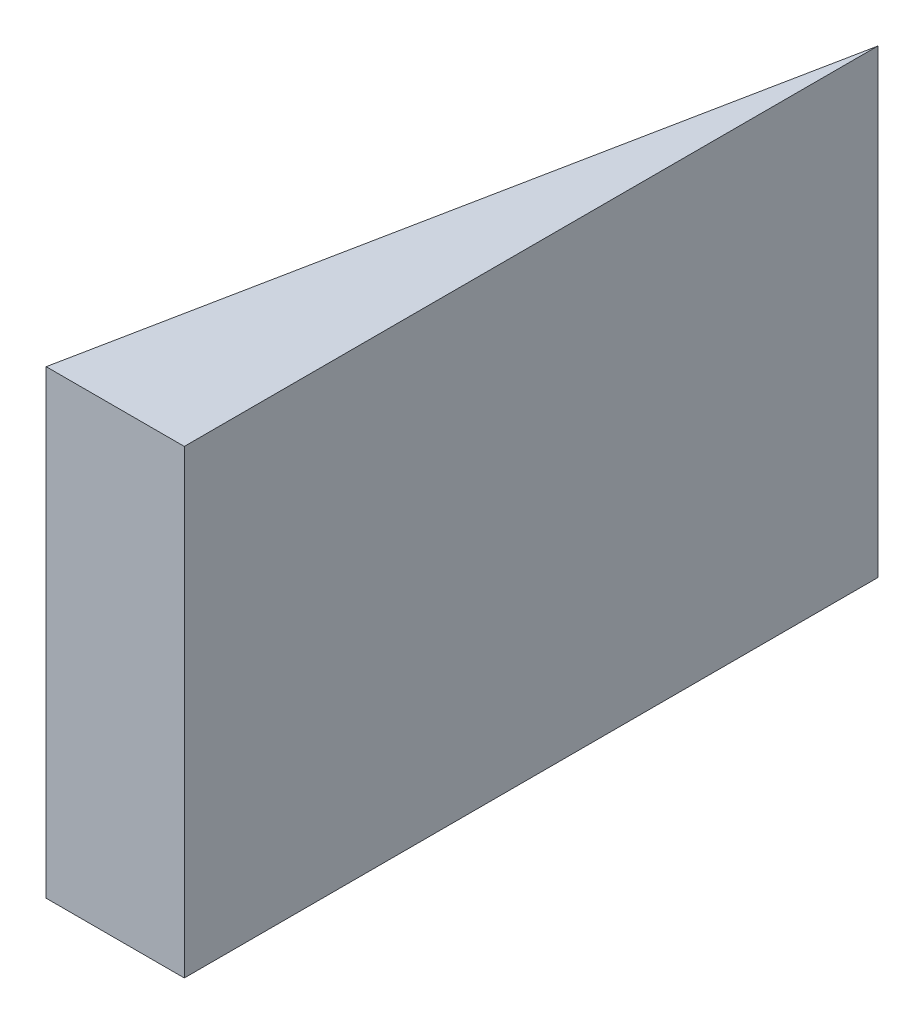
ISO-10303-21;
HEADER;
FILE_DESCRIPTION(('STEP AP214'),'2;1');
FILE_NAME('part.step','',(''),(''),'','','');
FILE_SCHEMA(('AUTOMOTIVE_DESIGN { 1 0 10303 214 1 1 1 1 }'));
ENDSEC;
DATA;
#1=APPLICATION_CONTEXT('core data for automotive mechanical design processes');
#2=APPLICATION_PROTOCOL_DEFINITION('international standard','automotive_design',2000,#1);
#3=PRODUCT_CONTEXT('',#1,'mechanical');
#4=PRODUCT('Part','Part','',(#3));
#5=PRODUCT_RELATED_PRODUCT_CATEGORY('part','',(#4));
#6=PRODUCT_DEFINITION_FORMATION('','',#4);
#7=PRODUCT_DEFINITION_CONTEXT('part definition',#1,'design');
#8=PRODUCT_DEFINITION('design','',#6,#7);
#9=PRODUCT_DEFINITION_SHAPE('','',#8);
#10=(LENGTH_UNIT() NAMED_UNIT(*) SI_UNIT(.MILLI.,.METRE.));
#11=(NAMED_UNIT(*) PLANE_ANGLE_UNIT() SI_UNIT($,.RADIAN.));
#12=(NAMED_UNIT(*) SI_UNIT($,.STERADIAN.) SOLID_ANGLE_UNIT());
#13=UNCERTAINTY_MEASURE_WITH_UNIT(LENGTH_MEASURE(1.E-05),#10,'distance_accuracy_value','');
#14=(GEOMETRIC_REPRESENTATION_CONTEXT(3) GLOBAL_UNCERTAINTY_ASSIGNED_CONTEXT((#13)) GLOBAL_UNIT_ASSIGNED_CONTEXT((#10,
#11,#12)) REPRESENTATION_CONTEXT('',''));
#15=CARTESIAN_POINT('',(0.,0.,0.));
#16=DIRECTION('',(0.,0.,1.));
#17=DIRECTION('',(1.,0.,0.));
#18=AXIS2_PLACEMENT_3D('',#15,#16,#17);
#19=CARTESIAN_POINT('',(-3.37532183744417,-0.749999455145353,-5.23287741907118));
#20=DIRECTION('',(-1.74845553146952E-07,-1.,-8.74227765734759E-08));
#21=DIRECTION('',(1.,-1.74845553146952E-07,0.));
#22=AXIS2_PLACEMENT_3D('',#19,#20,#21);
#23=PLANE('',#22);
#24=DIRECTION('',(-0.999999999999985,1.74845553220964E-07,0.));
#25=VECTOR('',#24,1.);
#26=CARTESIAN_POINT('',(-3.0000001311342,-0.749999659050171,-3.65112158656318));
#27=LINE('',#26,#25);
#28=CARTESIAN_POINT('',(-3.0000001311342,-0.749999659052171,-3.65112158656318));
#29=VERTEX_POINT('',#28);
#30=CARTESIAN_POINT('',(-3.3000001311342,-0.749999606598505,-3.65112158656418));
#31=VERTEX_POINT('',#30);
#32=EDGE_CURVE('E11',#29,#31,#27,.T.);
#33=ORIENTED_EDGE('',*,*,#32,.F.);
#34=DIRECTION('',(0.,-8.74227765663743E-08,0.999999999999996));
#35=VECTOR('',#34,1.);
#36=CARTESIAN_POINT('',(-3.00000013113417,-0.749999527353517,-5.15755571276118));
#37=LINE('',#36,#35);
#38=CARTESIAN_POINT('',(-3.00000013113417,-0.749999527355517,-5.15755571276018));
#39=VERTEX_POINT('',#38);
#40=EDGE_CURVE('E63',#39,#29,#37,.T.);
#41=ORIENTED_EDGE('',*,*,#40,.F.);
#42=DIRECTION('',(0.195310522456633,5.15899646635893E-08,-0.980741454114036));
#43=VECTOR('',#42,1.);
#44=CARTESIAN_POINT('',(-3.3000001311342,-0.749999606596505,-3.65112158656318));
#45=LINE('',#44,#43);
#46=EDGE_CURVE('E70',#31,#39,#45,.T.);
#47=ORIENTED_EDGE('',*,*,#46,.F.);
#48=EDGE_LOOP('',(#33,#41,#47));
#49=FACE_BOUND('',#48,.T.);
#50=ADVANCED_FACE('F17',(#49),#23,.F.);
#51=CARTESIAN_POINT('',(-3.37532201228973,-1.74999945514635,-5.23287750649395));
#52=DIRECTION('',(-1.74845553146952E-07,-1.,-8.74227765734759E-08));
#53=DIRECTION('',(1.,-1.74845553146952E-07,0.));
#54=AXIS2_PLACEMENT_3D('',#51,#52,#53);
#55=PLANE('',#54);
#56=DIRECTION('',(0.195310522456633,5.15899645913099E-08,-0.980741454114036));
#57=VECTOR('',#56,1.);
#58=CARTESIAN_POINT('',(-3.30000030597975,-1.74999960659751,-3.65112167398595));
#59=LINE('',#58,#57);
#60=CARTESIAN_POINT('',(-3.30000030597975,-1.74999960659651,-3.65112167398695));
#61=VERTEX_POINT('',#60);
#62=CARTESIAN_POINT('',(-3.00000030597973,-1.74999952735352,-5.15755580018295));
#63=VERTEX_POINT('',#62);
#64=EDGE_CURVE('E24',#61,#63,#59,.T.);
#65=ORIENTED_EDGE('',*,*,#64,.T.);
#66=DIRECTION('',(0.,-8.74227765663743E-08,0.999999999999996));
#67=VECTOR('',#66,1.);
#68=CARTESIAN_POINT('',(-3.00000030597973,-1.74999952735452,-5.15755580018395));
#69=LINE('',#68,#67);
#70=CARTESIAN_POINT('',(-3.00000030597975,-1.74999965905017,-3.65112167398595));
#71=VERTEX_POINT('',#70);
#72=EDGE_CURVE('E49',#63,#71,#69,.T.);
#73=ORIENTED_EDGE('',*,*,#72,.T.);
#74=DIRECTION('',(-0.999999999999985,1.74845553591038E-07,0.));
#75=VECTOR('',#74,1.);
#76=CARTESIAN_POINT('',(-3.00000030597975,-1.74999965905117,-3.65112167398595));
#77=LINE('',#76,#75);
#78=EDGE_CURVE('E46',#71,#61,#77,.T.);
#79=ORIENTED_EDGE('',*,*,#78,.T.);
#80=EDGE_LOOP('',(#65,#73,#79));
#81=FACE_BOUND('',#80,.T.);
#82=ADVANCED_FACE('F47',(#81),#55,.T.);
#83=CARTESIAN_POINT('',(-3.3000001311342,-0.749999606596505,-3.65112158656318));
#84=DIRECTION('',(-0.980741454114038,1.88552870228038E-07,-0.195310522456619));
#85=DIRECTION('',(0.195310522456634,5.15899646850099E-08,-0.980741454114041));
#86=AXIS2_PLACEMENT_3D('',#83,#84,#85);
#87=PLANE('',#86);
#88=ORIENTED_EDGE('',*,*,#46,.T.);
#89=DIRECTION('',(-1.74845553146774E-07,-0.999999999999981,-8.74227774615652E-08));
#90=VECTOR('',#89,1.);
#91=CARTESIAN_POINT('',(-3.00000013113417,-0.749999527353517,-5.15755571276118));
#92=LINE('',#91,#90);
#93=EDGE_CURVE('E54',#39,#63,#92,.T.);
#94=ORIENTED_EDGE('',*,*,#93,.T.);
#95=ORIENTED_EDGE('',*,*,#64,.F.);
#96=DIRECTION('',(-1.74845553146774E-07,-0.999999999999981,-8.74227765733868E-08));
#97=VECTOR('',#96,1.);
#98=CARTESIAN_POINT('',(-3.3000001311342,-0.749999606596505,-3.65112158656318));
#99=LINE('',#98,#97);
#100=EDGE_CURVE('E61',#31,#61,#99,.T.);
#101=ORIENTED_EDGE('',*,*,#100,.F.);
#102=EDGE_LOOP('',(#88,#94,#95,#101));
#103=FACE_BOUND('',#102,.T.);
#104=ADVANCED_FACE('F60',(#103),#87,.T.);
#105=CARTESIAN_POINT('',(-3.00000013113417,-0.749999527353517,-5.15755571276118));
#106=DIRECTION('',(1.,-1.74845553146952E-07,0.));
#107=DIRECTION('',(0.,-8.74227765734759E-08,1.));
#108=AXIS2_PLACEMENT_3D('',#105,#106,#107);
#109=PLANE('',#108);
#110=ORIENTED_EDGE('',*,*,#40,.T.);
#111=DIRECTION('',(-1.74845553146774E-07,-0.999999999999981,-8.74227765733868E-08));
#112=VECTOR('',#111,1.);
#113=CARTESIAN_POINT('',(-3.0000001311342,-0.749999659050171,-3.65112158656318));
#114=LINE('',#113,#112);
#115=EDGE_CURVE('E55',#29,#71,#114,.T.);
#116=ORIENTED_EDGE('',*,*,#115,.T.);
#117=ORIENTED_EDGE('',*,*,#72,.F.);
#118=ORIENTED_EDGE('',*,*,#93,.F.);
#119=EDGE_LOOP('',(#110,#116,#117,#118));
#120=FACE_BOUND('',#119,.T.);
#121=ADVANCED_FACE('F73',(#120),#109,.T.);
#122=CARTESIAN_POINT('',(-3.0000001311342,-0.749999659050171,-3.65112158656318));
#123=DIRECTION('',(0.,-8.74227765734759E-08,1.));
#124=DIRECTION('',(-1.,1.74845553146952E-07,0.));
#125=AXIS2_PLACEMENT_3D('',#122,#123,#124);
#126=PLANE('',#125);
#127=ORIENTED_EDGE('',*,*,#32,.T.);
#128=ORIENTED_EDGE('',*,*,#100,.T.);
#129=ORIENTED_EDGE('',*,*,#78,.F.);
#130=ORIENTED_EDGE('',*,*,#115,.F.);
#131=EDGE_LOOP('',(#127,#128,#129,#130));
#132=FACE_BOUND('',#131,.T.);
#133=ADVANCED_FACE('F64',(#132),#126,.T.);
#134=CLOSED_SHELL('',(#50,#82,#104,#121,#133));
#135=MANIFOLD_SOLID_BREP('B1',#134);
#136=ADVANCED_BREP_SHAPE_REPRESENTATION('',(#18,#135),#14);
#137=SHAPE_DEFINITION_REPRESENTATION(#9,#136);
ENDSEC;
END-ISO-10303-21;
